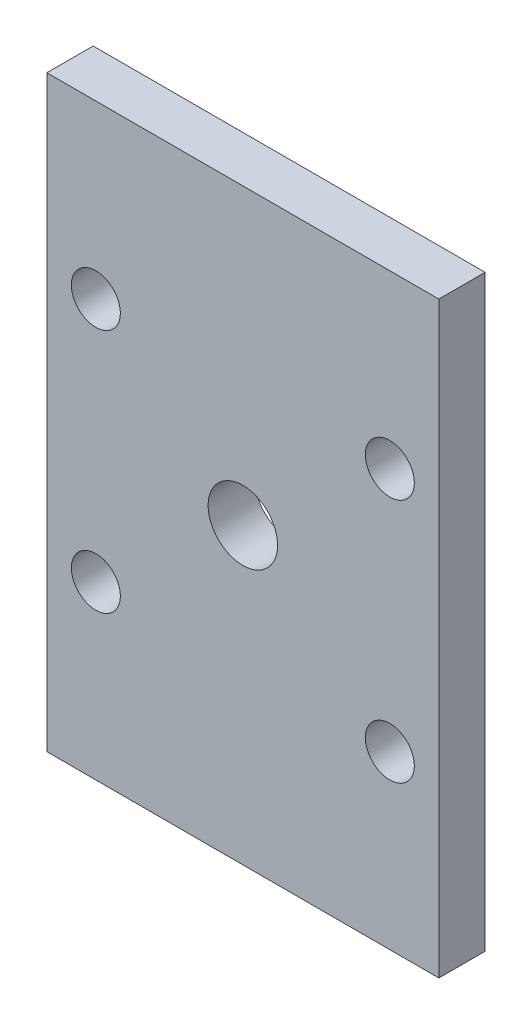
ISO-10303-21;
HEADER;
FILE_DESCRIPTION(('STEP AP214'),'2;1');
FILE_NAME('part.step','',(''),(''),'','','');
FILE_SCHEMA(('AUTOMOTIVE_DESIGN { 1 0 10303 214 1 1 1 1 }'));
ENDSEC;
DATA;
#1=APPLICATION_CONTEXT('core data for automotive mechanical design processes');
#2=APPLICATION_PROTOCOL_DEFINITION('international standard','automotive_design',2000,#1);
#3=PRODUCT_CONTEXT('',#1,'mechanical');
#4=PRODUCT('Part','Part','',(#3));
#5=PRODUCT_RELATED_PRODUCT_CATEGORY('part','',(#4));
#6=PRODUCT_DEFINITION_FORMATION('','',#4);
#7=PRODUCT_DEFINITION_CONTEXT('part definition',#1,'design');
#8=PRODUCT_DEFINITION('design','',#6,#7);
#9=PRODUCT_DEFINITION_SHAPE('','',#8);
#10=(LENGTH_UNIT() NAMED_UNIT(*) SI_UNIT(.MILLI.,.METRE.));
#11=(NAMED_UNIT(*) PLANE_ANGLE_UNIT() SI_UNIT($,.RADIAN.));
#12=(NAMED_UNIT(*) SI_UNIT($,.STERADIAN.) SOLID_ANGLE_UNIT());
#13=UNCERTAINTY_MEASURE_WITH_UNIT(LENGTH_MEASURE(1.E-05),#10,'distance_accuracy_value','');
#14=(GEOMETRIC_REPRESENTATION_CONTEXT(3) GLOBAL_UNCERTAINTY_ASSIGNED_CONTEXT((#13)) GLOBAL_UNIT_ASSIGNED_CONTEXT((#10,
#11,#12)) REPRESENTATION_CONTEXT('',''));
#15=CARTESIAN_POINT('',(0.,0.,0.));
#16=DIRECTION('',(0.,0.,1.));
#17=DIRECTION('',(1.,0.,0.));
#18=AXIS2_PLACEMENT_3D('',#15,#16,#17);
#19=CARTESIAN_POINT('',(0.,0.,6.));
#20=DIRECTION('',(1.,0.,0.));
#21=DIRECTION('',(0.,0.,-1.));
#22=AXIS2_PLACEMENT_3D('',#19,#20,#21);
#23=PLANE('',#22);
#24=DIRECTION('',(0.,-1.,0.));
#25=VECTOR('',#24,1.);
#26=CARTESIAN_POINT('',(0.,0.,0.));
#27=LINE('',#26,#25);
#28=CARTESIAN_POINT('',(0.,76.2,0.));
#29=VERTEX_POINT('',#28);
#30=CARTESIAN_POINT('',(0.,0.,0.));
#31=VERTEX_POINT('',#30);
#32=EDGE_CURVE('E97',#29,#31,#27,.T.);
#33=ORIENTED_EDGE('',*,*,#32,.T.);
#34=DIRECTION('',(0.,0.,-1.));
#35=VECTOR('',#34,1.);
#36=CARTESIAN_POINT('',(0.,0.,6.));
#37=LINE('',#36,#35);
#38=CARTESIAN_POINT('',(0.,0.,6.));
#39=VERTEX_POINT('',#38);
#40=EDGE_CURVE('E11',#39,#31,#37,.T.);
#41=ORIENTED_EDGE('',*,*,#40,.F.);
#42=DIRECTION('',(0.,-1.,0.));
#43=VECTOR('',#42,1.);
#44=CARTESIAN_POINT('',(0.,0.,6.));
#45=LINE('',#44,#43);
#46=CARTESIAN_POINT('',(0.,76.2,6.));
#47=VERTEX_POINT('',#46);
#48=EDGE_CURVE('E85',#47,#39,#45,.T.);
#49=ORIENTED_EDGE('',*,*,#48,.F.);
#50=DIRECTION('',(0.,0.,-1.));
#51=VECTOR('',#50,1.);
#52=CARTESIAN_POINT('',(0.,76.2,6.));
#53=LINE('',#52,#51);
#54=EDGE_CURVE('E93',#47,#29,#53,.T.);
#55=ORIENTED_EDGE('',*,*,#54,.T.);
#56=EDGE_LOOP('',(#33,#41,#49,#55));
#57=FACE_BOUND('',#56,.T.);
#58=ADVANCED_FACE('F34',(#57),#23,.F.);
#59=CARTESIAN_POINT('',(0.,0.,6.));
#60=DIRECTION('',(0.,1.,0.));
#61=DIRECTION('',(0.,0.,1.));
#62=AXIS2_PLACEMENT_3D('',#59,#60,#61);
#63=PLANE('',#62);
#64=DIRECTION('',(1.,0.,0.));
#65=VECTOR('',#64,1.);
#66=CARTESIAN_POINT('',(0.,0.,0.));
#67=LINE('',#66,#65);
#68=CARTESIAN_POINT('',(50.8,0.,0.));
#69=VERTEX_POINT('',#68);
#70=EDGE_CURVE('E89',#31,#69,#67,.T.);
#71=ORIENTED_EDGE('',*,*,#70,.T.);
#72=DIRECTION('',(0.,0.,-1.));
#73=VECTOR('',#72,1.);
#74=CARTESIAN_POINT('',(50.8,0.,6.));
#75=LINE('',#74,#73);
#76=CARTESIAN_POINT('',(50.8,0.,6.));
#77=VERTEX_POINT('',#76);
#78=EDGE_CURVE('E42',#77,#69,#75,.T.);
#79=ORIENTED_EDGE('',*,*,#78,.F.);
#80=DIRECTION('',(1.,0.,0.));
#81=VECTOR('',#80,1.);
#82=CARTESIAN_POINT('',(0.,0.,6.));
#83=LINE('',#82,#81);
#84=EDGE_CURVE('E80',#39,#77,#83,.T.);
#85=ORIENTED_EDGE('',*,*,#84,.F.);
#86=ORIENTED_EDGE('',*,*,#40,.T.);
#87=EDGE_LOOP('',(#71,#79,#85,#86));
#88=FACE_BOUND('',#87,.T.);
#89=ADVANCED_FACE('F88',(#88),#63,.F.);
#90=CARTESIAN_POINT('',(50.8,0.,6.));
#91=DIRECTION('',(-1.,0.,0.));
#92=DIRECTION('',(0.,0.,1.));
#93=AXIS2_PLACEMENT_3D('',#90,#91,#92);
#94=PLANE('',#93);
#95=DIRECTION('',(0.,1.,0.));
#96=VECTOR('',#95,1.);
#97=CARTESIAN_POINT('',(50.8,0.,0.));
#98=LINE('',#97,#96);
#99=CARTESIAN_POINT('',(50.8,76.2,0.));
#100=VERTEX_POINT('',#99);
#101=EDGE_CURVE('E67',#69,#100,#98,.T.);
#102=ORIENTED_EDGE('',*,*,#101,.T.);
#103=DIRECTION('',(0.,0.,-1.));
#104=VECTOR('',#103,1.);
#105=CARTESIAN_POINT('',(50.8,76.2,6.));
#106=LINE('',#105,#104);
#107=CARTESIAN_POINT('',(50.8,76.2,6.));
#108=VERTEX_POINT('',#107);
#109=EDGE_CURVE('E90',#108,#100,#106,.T.);
#110=ORIENTED_EDGE('',*,*,#109,.F.);
#111=DIRECTION('',(0.,1.,0.));
#112=VECTOR('',#111,1.);
#113=CARTESIAN_POINT('',(50.8,0.,6.));
#114=LINE('',#113,#112);
#115=EDGE_CURVE('E83',#77,#108,#114,.T.);
#116=ORIENTED_EDGE('',*,*,#115,.F.);
#117=ORIENTED_EDGE('',*,*,#78,.T.);
#118=EDGE_LOOP('',(#102,#110,#116,#117));
#119=FACE_BOUND('',#118,.T.);
#120=ADVANCED_FACE('F91',(#119),#94,.F.);
#121=CARTESIAN_POINT('',(0.,76.2,6.));
#122=DIRECTION('',(0.,-1.,0.));
#123=DIRECTION('',(0.,0.,-1.));
#124=AXIS2_PLACEMENT_3D('',#121,#122,#123);
#125=PLANE('',#124);
#126=DIRECTION('',(-1.,0.,0.));
#127=VECTOR('',#126,1.);
#128=CARTESIAN_POINT('',(0.,76.2,0.));
#129=LINE('',#128,#127);
#130=EDGE_CURVE('E73',#100,#29,#129,.T.);
#131=ORIENTED_EDGE('',*,*,#130,.T.);
#132=ORIENTED_EDGE('',*,*,#54,.F.);
#133=DIRECTION('',(-1.,0.,0.));
#134=VECTOR('',#133,1.);
#135=CARTESIAN_POINT('',(0.,76.2,6.));
#136=LINE('',#135,#134);
#137=EDGE_CURVE('E50',#108,#47,#136,.T.);
#138=ORIENTED_EDGE('',*,*,#137,.F.);
#139=ORIENTED_EDGE('',*,*,#109,.T.);
#140=EDGE_LOOP('',(#131,#132,#138,#139));
#141=FACE_BOUND('',#140,.T.);
#142=ADVANCED_FACE('F105',(#141),#125,.F.);
#143=CARTESIAN_POINT('',(0.,0.,6.));
#144=DIRECTION('',(0.,0.,-1.));
#145=DIRECTION('',(-1.,0.,0.));
#146=AXIS2_PLACEMENT_3D('',#143,#144,#145);
#147=PLANE('',#146);
#148=CARTESIAN_POINT('',(25.4,38.1,6.));
#149=DIRECTION('',(0.,0.,1.));
#150=DIRECTION('',(1.,0.,0.));
#151=AXIS2_PLACEMENT_3D('',#148,#149,#150);
#152=CIRCLE('',#151,4.5);
#153=CARTESIAN_POINT('',(29.9,38.1,6.));
#154=VERTEX_POINT('',#153);
#155=EDGE_CURVE('E135',#154,#154,#152,.T.);
#156=ORIENTED_EDGE('',*,*,#155,.F.);
#157=EDGE_LOOP('',(#156));
#158=FACE_BOUND('',#157,.T.);
#159=CARTESIAN_POINT('',(44.45,53.975,6.));
#160=DIRECTION('',(0.,0.,1.));
#161=DIRECTION('',(1.,0.,0.));
#162=AXIS2_PLACEMENT_3D('',#159,#160,#161);
#163=CIRCLE('',#162,3.175);
#164=CARTESIAN_POINT('',(47.625,53.975,6.));
#165=VERTEX_POINT('',#164);
#166=EDGE_CURVE('E131',#165,#165,#163,.T.);
#167=ORIENTED_EDGE('',*,*,#166,.F.);
#168=EDGE_LOOP('',(#167));
#169=FACE_BOUND('',#168,.T.);
#170=CARTESIAN_POINT('',(6.34999999999999,53.975,6.));
#171=DIRECTION('',(0.,0.,1.));
#172=DIRECTION('',(1.,0.,0.));
#173=AXIS2_PLACEMENT_3D('',#170,#171,#172);
#174=CIRCLE('',#173,3.175);
#175=CARTESIAN_POINT('',(9.525,53.975,6.));
#176=VERTEX_POINT('',#175);
#177=EDGE_CURVE('E125',#176,#176,#174,.T.);
#178=ORIENTED_EDGE('',*,*,#177,.F.);
#179=EDGE_LOOP('',(#178));
#180=FACE_BOUND('',#179,.T.);
#181=CARTESIAN_POINT('',(6.34999999999999,22.225,6.));
#182=DIRECTION('',(0.,0.,1.));
#183=DIRECTION('',(1.,0.,0.));
#184=AXIS2_PLACEMENT_3D('',#181,#182,#183);
#185=CIRCLE('',#184,3.175);
#186=CARTESIAN_POINT('',(9.525,22.225,6.));
#187=VERTEX_POINT('',#186);
#188=EDGE_CURVE('E119',#187,#187,#185,.T.);
#189=ORIENTED_EDGE('',*,*,#188,.F.);
#190=EDGE_LOOP('',(#189));
#191=FACE_BOUND('',#190,.T.);
#192=CARTESIAN_POINT('',(44.45,22.225,6.));
#193=DIRECTION('',(0.,0.,1.));
#194=DIRECTION('',(1.,0.,0.));
#195=AXIS2_PLACEMENT_3D('',#192,#193,#194);
#196=CIRCLE('',#195,3.175);
#197=CARTESIAN_POINT('',(47.625,22.225,6.));
#198=VERTEX_POINT('',#197);
#199=EDGE_CURVE('E113',#198,#198,#196,.T.);
#200=ORIENTED_EDGE('',*,*,#199,.F.);
#201=EDGE_LOOP('',(#200));
#202=FACE_BOUND('',#201,.T.);
#203=ORIENTED_EDGE('',*,*,#48,.T.);
#204=ORIENTED_EDGE('',*,*,#84,.T.);
#205=ORIENTED_EDGE('',*,*,#115,.T.);
#206=ORIENTED_EDGE('',*,*,#137,.T.);
#207=EDGE_LOOP('',(#203,#204,#205,#206));
#208=FACE_BOUND('',#207,.T.);
#209=ADVANCED_FACE('F81',(#158,#169,#180,#191,#202,#208),#147,.F.);
#210=CARTESIAN_POINT('',(0.,0.,0.));
#211=DIRECTION('',(0.,0.,-1.));
#212=DIRECTION('',(-1.,0.,0.));
#213=AXIS2_PLACEMENT_3D('',#210,#211,#212);
#214=PLANE('',#213);
#215=CARTESIAN_POINT('',(25.4,38.1,0.));
#216=DIRECTION('',(0.,0.,1.));
#217=DIRECTION('',(1.,0.,0.));
#218=AXIS2_PLACEMENT_3D('',#215,#216,#217);
#219=CIRCLE('',#218,4.5);
#220=CARTESIAN_POINT('',(29.9,38.1,0.));
#221=VERTEX_POINT('',#220);
#222=EDGE_CURVE('E134',#221,#221,#219,.T.);
#223=ORIENTED_EDGE('',*,*,#222,.T.);
#224=EDGE_LOOP('',(#223));
#225=FACE_BOUND('',#224,.T.);
#226=CARTESIAN_POINT('',(44.45,53.975,0.));
#227=DIRECTION('',(0.,0.,1.));
#228=DIRECTION('',(1.,0.,0.));
#229=AXIS2_PLACEMENT_3D('',#226,#227,#228);
#230=CIRCLE('',#229,3.175);
#231=CARTESIAN_POINT('',(47.625,53.975,0.));
#232=VERTEX_POINT('',#231);
#233=EDGE_CURVE('E128',#232,#232,#230,.T.);
#234=ORIENTED_EDGE('',*,*,#233,.T.);
#235=EDGE_LOOP('',(#234));
#236=FACE_BOUND('',#235,.T.);
#237=CARTESIAN_POINT('',(6.34999999999999,53.975,0.));
#238=DIRECTION('',(0.,0.,1.));
#239=DIRECTION('',(1.,0.,0.));
#240=AXIS2_PLACEMENT_3D('',#237,#238,#239);
#241=CIRCLE('',#240,3.175);
#242=CARTESIAN_POINT('',(9.52499999999999,53.975,0.));
#243=VERTEX_POINT('',#242);
#244=EDGE_CURVE('E122',#243,#243,#241,.T.);
#245=ORIENTED_EDGE('',*,*,#244,.T.);
#246=EDGE_LOOP('',(#245));
#247=FACE_BOUND('',#246,.T.);
#248=CARTESIAN_POINT('',(6.34999999999999,22.225,0.));
#249=DIRECTION('',(0.,0.,1.));
#250=DIRECTION('',(1.,0.,0.));
#251=AXIS2_PLACEMENT_3D('',#248,#249,#250);
#252=CIRCLE('',#251,3.175);
#253=CARTESIAN_POINT('',(9.52499999999999,22.225,0.));
#254=VERTEX_POINT('',#253);
#255=EDGE_CURVE('E116',#254,#254,#252,.T.);
#256=ORIENTED_EDGE('',*,*,#255,.T.);
#257=EDGE_LOOP('',(#256));
#258=FACE_BOUND('',#257,.T.);
#259=CARTESIAN_POINT('',(44.45,22.225,0.));
#260=DIRECTION('',(0.,0.,1.));
#261=DIRECTION('',(1.,0.,0.));
#262=AXIS2_PLACEMENT_3D('',#259,#260,#261);
#263=CIRCLE('',#262,3.175);
#264=CARTESIAN_POINT('',(47.625,22.225,0.));
#265=VERTEX_POINT('',#264);
#266=EDGE_CURVE('E100',#265,#265,#263,.T.);
#267=ORIENTED_EDGE('',*,*,#266,.T.);
#268=EDGE_LOOP('',(#267));
#269=FACE_BOUND('',#268,.T.);
#270=ORIENTED_EDGE('',*,*,#32,.F.);
#271=ORIENTED_EDGE('',*,*,#130,.F.);
#272=ORIENTED_EDGE('',*,*,#101,.F.);
#273=ORIENTED_EDGE('',*,*,#70,.F.);
#274=EDGE_LOOP('',(#270,#271,#272,#273));
#275=FACE_BOUND('',#274,.T.);
#276=ADVANCED_FACE('F108',(#225,#236,#247,#258,#269,#275),#214,.T.);
#277=CARTESIAN_POINT('',(44.45,22.225,6.));
#278=DIRECTION('',(0.,0.,1.));
#279=DIRECTION('',(1.,0.,0.));
#280=AXIS2_PLACEMENT_3D('',#277,#278,#279);
#281=CYLINDRICAL_SURFACE('',#280,3.175);
#282=ORIENTED_EDGE('',*,*,#266,.F.);
#283=EDGE_LOOP('',(#282));
#284=FACE_BOUND('',#283,.T.);
#285=ORIENTED_EDGE('',*,*,#199,.T.);
#286=EDGE_LOOP('',(#285));
#287=FACE_BOUND('',#286,.T.);
#288=ADVANCED_FACE('F161',(#284,#287),#281,.F.);
#289=CARTESIAN_POINT('',(6.34999999999999,22.225,6.));
#290=DIRECTION('',(0.,0.,1.));
#291=DIRECTION('',(1.,0.,0.));
#292=AXIS2_PLACEMENT_3D('',#289,#290,#291);
#293=CYLINDRICAL_SURFACE('',#292,3.175);
#294=ORIENTED_EDGE('',*,*,#255,.F.);
#295=EDGE_LOOP('',(#294));
#296=FACE_BOUND('',#295,.T.);
#297=ORIENTED_EDGE('',*,*,#188,.T.);
#298=EDGE_LOOP('',(#297));
#299=FACE_BOUND('',#298,.T.);
#300=ADVANCED_FACE('F163',(#296,#299),#293,.F.);
#301=CARTESIAN_POINT('',(6.34999999999999,53.975,6.));
#302=DIRECTION('',(0.,0.,1.));
#303=DIRECTION('',(1.,0.,0.));
#304=AXIS2_PLACEMENT_3D('',#301,#302,#303);
#305=CYLINDRICAL_SURFACE('',#304,3.175);
#306=ORIENTED_EDGE('',*,*,#244,.F.);
#307=EDGE_LOOP('',(#306));
#308=FACE_BOUND('',#307,.T.);
#309=ORIENTED_EDGE('',*,*,#177,.T.);
#310=EDGE_LOOP('',(#309));
#311=FACE_BOUND('',#310,.T.);
#312=ADVANCED_FACE('F170',(#308,#311),#305,.F.);
#313=CARTESIAN_POINT('',(44.45,53.975,6.));
#314=DIRECTION('',(0.,0.,1.));
#315=DIRECTION('',(1.,0.,0.));
#316=AXIS2_PLACEMENT_3D('',#313,#314,#315);
#317=CYLINDRICAL_SURFACE('',#316,3.175);
#318=ORIENTED_EDGE('',*,*,#233,.F.);
#319=EDGE_LOOP('',(#318));
#320=FACE_BOUND('',#319,.T.);
#321=ORIENTED_EDGE('',*,*,#166,.T.);
#322=EDGE_LOOP('',(#321));
#323=FACE_BOUND('',#322,.T.);
#324=ADVANCED_FACE('F146',(#320,#323),#317,.F.);
#325=CARTESIAN_POINT('',(25.4,38.1,0.));
#326=DIRECTION('',(0.,0.,1.));
#327=DIRECTION('',(1.,0.,0.));
#328=AXIS2_PLACEMENT_3D('',#325,#326,#327);
#329=CYLINDRICAL_SURFACE('',#328,4.5);
#330=ORIENTED_EDGE('',*,*,#222,.F.);
#331=EDGE_LOOP('',(#330));
#332=FACE_BOUND('',#331,.T.);
#333=ORIENTED_EDGE('',*,*,#155,.T.);
#334=EDGE_LOOP('',(#333));
#335=FACE_BOUND('',#334,.T.);
#336=ADVANCED_FACE('F143',(#332,#335),#329,.F.);
#337=CLOSED_SHELL('',(#58,#89,#120,#142,#209,#276,#288,#300,#312,#324,#336));
#338=MANIFOLD_SOLID_BREP('B2',#337);
#339=ADVANCED_BREP_SHAPE_REPRESENTATION('',(#18,#338),#14);
#340=SHAPE_DEFINITION_REPRESENTATION(#9,#339);
ENDSEC;
END-ISO-10303-21;
